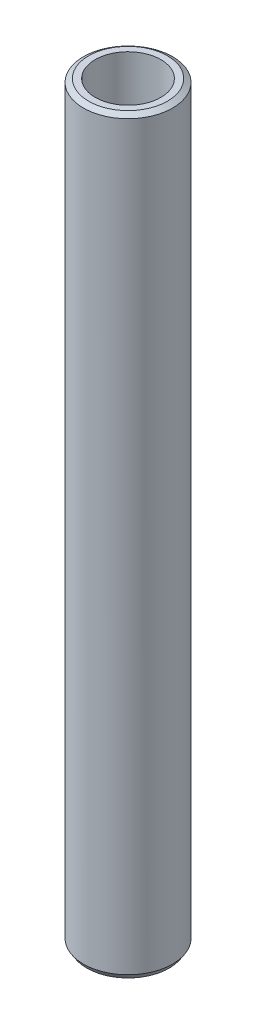
ISO-10303-21;
HEADER;
FILE_DESCRIPTION(('STEP AP214'),'2;1');
FILE_NAME('part.step','',(''),(''),'','','');
FILE_SCHEMA(('AUTOMOTIVE_DESIGN { 1 0 10303 214 1 1 1 1 }'));
ENDSEC;
DATA;
#1=APPLICATION_CONTEXT('core data for automotive mechanical design processes');
#2=APPLICATION_PROTOCOL_DEFINITION('international standard','automotive_design',2000,#1);
#3=PRODUCT_CONTEXT('',#1,'mechanical');
#4=PRODUCT('Part','Part','',(#3));
#5=PRODUCT_RELATED_PRODUCT_CATEGORY('part','',(#4));
#6=PRODUCT_DEFINITION_FORMATION('','',#4);
#7=PRODUCT_DEFINITION_CONTEXT('part definition',#1,'design');
#8=PRODUCT_DEFINITION('design','',#6,#7);
#9=PRODUCT_DEFINITION_SHAPE('','',#8);
#10=(LENGTH_UNIT() NAMED_UNIT(*) SI_UNIT(.MILLI.,.METRE.));
#11=(NAMED_UNIT(*) PLANE_ANGLE_UNIT() SI_UNIT($,.RADIAN.));
#12=(NAMED_UNIT(*) SI_UNIT($,.STERADIAN.) SOLID_ANGLE_UNIT());
#13=UNCERTAINTY_MEASURE_WITH_UNIT(LENGTH_MEASURE(1.E-05),#10,'distance_accuracy_value','');
#14=(GEOMETRIC_REPRESENTATION_CONTEXT(3) GLOBAL_UNCERTAINTY_ASSIGNED_CONTEXT((#13)) GLOBAL_UNIT_ASSIGNED_CONTEXT((#10,
#11,#12)) REPRESENTATION_CONTEXT('',''));
#15=CARTESIAN_POINT('',(0.,0.,0.));
#16=DIRECTION('',(0.,0.,1.));
#17=DIRECTION('',(1.,0.,0.));
#18=AXIS2_PLACEMENT_3D('',#15,#16,#17);
#19=CARTESIAN_POINT('',(0.,336.498548134909,0.));
#20=DIRECTION('',(0.,-1.,0.));
#21=DIRECTION('',(0.,0.,-1.));
#22=AXIS2_PLACEMENT_3D('',#19,#20,#21);
#23=CYLINDRICAL_SURFACE('',#22,20.);
#24=CARTESIAN_POINT('',(0.,334.996959689852,0.));
#25=DIRECTION('',(0.,1.,0.));
#26=DIRECTION('',(0.,0.,1.));
#27=AXIS2_PLACEMENT_3D('',#24,#25,#26);
#28=CIRCLE('',#27,20.);
#29=CARTESIAN_POINT('',(0.,334.996959689852,-20.));
#30=VERTEX_POINT('',#29);
#31=EDGE_CURVE('E50',#30,#30,#28,.F.);
#32=CARTESIAN_POINT('',(0.,2.32911628656407,0.));
#33=DIRECTION('',(0.,1.,0.));
#34=DIRECTION('',(0.,0.,1.));
#35=AXIS2_PLACEMENT_3D('',#32,#33,#34);
#36=CIRCLE('',#35,20.);
#37=CARTESIAN_POINT('',(0.,2.32911628656401,-20.));
#38=VERTEX_POINT('',#37);
#39=EDGE_CURVE('E51',#38,#38,#36,.T.);
#40=CARTESIAN_POINT('',(0.,334.996959689852,-20.));
#41=CARTESIAN_POINT('',(0.,331.531669654401,-20.));
#42=CARTESIAN_POINT('',(0.,328.06637961895,-20.));
#43=CARTESIAN_POINT('',(0.,321.135799548048,-20.));
#44=CARTESIAN_POINT('',(0.,317.670509512597,-20.));
#45=CARTESIAN_POINT('',(0.,310.739929441695,-20.));
#46=CARTESIAN_POINT('',(0.,307.274639406244,-20.));
#47=CARTESIAN_POINT('',(0.,300.344059335343,-20.));
#48=CARTESIAN_POINT('',(0.,296.878769299892,-20.));
#49=CARTESIAN_POINT('',(0.,289.94818922899,-20.));
#50=CARTESIAN_POINT('',(0.,286.482899193539,-20.));
#51=CARTESIAN_POINT('',(0.,279.552319122637,-20.));
#52=CARTESIAN_POINT('',(0.,276.087029087186,-20.));
#53=CARTESIAN_POINT('',(0.,269.156449016284,-20.));
#54=CARTESIAN_POINT('',(0.,265.691158980834,-20.));
#55=CARTESIAN_POINT('',(0.,258.760578909932,-20.));
#56=CARTESIAN_POINT('',(0.,255.295288874481,-20.));
#57=CARTESIAN_POINT('',(0.,248.364708803579,-20.));
#58=CARTESIAN_POINT('',(0.,244.899418768128,-20.));
#59=CARTESIAN_POINT('',(0.,237.968838697226,-20.));
#60=CARTESIAN_POINT('',(0.,234.503548661775,-20.));
#61=CARTESIAN_POINT('',(0.,227.572968590873,-20.));
#62=CARTESIAN_POINT('',(0.,224.107678555423,-20.));
#63=CARTESIAN_POINT('',(0.,217.177098484521,-20.));
#64=CARTESIAN_POINT('',(0.,213.71180844907,-20.));
#65=CARTESIAN_POINT('',(0.,206.781228378168,-20.));
#66=CARTESIAN_POINT('',(0.,203.315938342717,-20.));
#67=CARTESIAN_POINT('',(0.,196.385358271815,-20.));
#68=CARTESIAN_POINT('',(0.,192.920068236364,-20.));
#69=CARTESIAN_POINT('',(0.,185.989488165462,-20.));
#70=CARTESIAN_POINT('',(0.,182.524198130012,-20.));
#71=CARTESIAN_POINT('',(0.,175.59361805911,-20.));
#72=CARTESIAN_POINT('',(0.,172.128328023659,-20.));
#73=CARTESIAN_POINT('',(0.,165.197747952757,-20.));
#74=CARTESIAN_POINT('',(0.,161.732457917306,-20.));
#75=CARTESIAN_POINT('',(0.,154.801877846404,-20.));
#76=CARTESIAN_POINT('',(0.,151.336587810953,-20.));
#77=CARTESIAN_POINT('',(0.,144.406007740052,-20.));
#78=CARTESIAN_POINT('',(0.,140.940717704601,-20.));
#79=CARTESIAN_POINT('',(0.,134.010137633699,-20.));
#80=CARTESIAN_POINT('',(0.,130.544847598248,-20.));
#81=CARTESIAN_POINT('',(0.,123.614267527346,-20.));
#82=CARTESIAN_POINT('',(0.,120.148977491895,-20.));
#83=CARTESIAN_POINT('',(0.,113.218397420993,-20.));
#84=CARTESIAN_POINT('',(0.,109.753107385542,-20.));
#85=CARTESIAN_POINT('',(0.,102.822527314641,-20.));
#86=CARTESIAN_POINT('',(0.,99.3572372791896,-20.));
#87=CARTESIAN_POINT('',(0.,92.4266572082878,-20.));
#88=CARTESIAN_POINT('',(0.,88.9613671728369,-20.));
#89=CARTESIAN_POINT('',(0.,82.030787101935,-20.));
#90=CARTESIAN_POINT('',(0.,78.5654970664841,-20.));
#91=CARTESIAN_POINT('',(0.,71.6349169955823,-20.));
#92=CARTESIAN_POINT('',(0.,68.1696269601314,-20.));
#93=CARTESIAN_POINT('',(0.,61.2390468892295,-20.));
#94=CARTESIAN_POINT('',(0.,57.7737568537786,-20.));
#95=CARTESIAN_POINT('',(0.,50.8431767828768,-20.));
#96=CARTESIAN_POINT('',(0.,47.3778867474259,-20.));
#97=CARTESIAN_POINT('',(0.,40.4473066765241,-20.));
#98=CARTESIAN_POINT('',(0.,36.9820166410732,-20.));
#99=CARTESIAN_POINT('',(0.,30.0514365701713,-20.));
#100=CARTESIAN_POINT('',(0.,26.5861465347204,-20.));
#101=CARTESIAN_POINT('',(0.,19.6555664638186,-20.));
#102=CARTESIAN_POINT('',(0.,16.1902764283676,-20.));
#103=CARTESIAN_POINT('',(0.,9.2596963574658,-20.));
#104=CARTESIAN_POINT('',(0.,5.7944063220149,-20.));
#105=CARTESIAN_POINT('',(0.,2.32911628656401,-20.));
#106=B_SPLINE_CURVE_WITH_KNOTS('',3,(#40,#41,#42,#43,#44,#45,#46,#47,#48,#49,#50,#51,#52,#53,
#54,#55,#56,#57,#58,#59,#60,#61,#62,#63,#64,#65,#66,#67,#68,#69,#70,#71,#72,#73,#74,#75,#76,#77,
#78,#79,#80,#81,#82,#83,#84,#85,#86,#87,#88,#89,#90,#91,#92,#93,#94,#95,#96,#97,#98,#99,#100,
#101,#102,#103,#104,#105),.UNSPECIFIED.,.F.,.F.,(4,2,2,2,2,2,2,2,2,2,2,2,2,2,2,2,2,2,2,2,2,2,2,
2,2,2,2,2,2,2,2,2,4),(0.,10.3958701063527,20.7917402127055,31.1876103190582,41.5834804254109,
51.9793505317637,62.3752206381164,72.7710907444692,83.1669608508219,93.5628309571747,
103.958701063527,114.35457116988,124.750441276233,135.146311382586,145.542181488938,
155.938051595291,166.333921701644,176.729791807997,187.125661914349,197.521532020702,
207.917402127055,218.313272233408,228.70914233976,239.105012446113,249.500882552466,
259.896752658819,270.292622765171,280.688492871524,291.084362977877,301.480233084229,
311.876103190582,322.271973296935,332.667843403288),.UNSPECIFIED.);
#107=EDGE_CURVE('BSEAM39',#30,#38,#106,.T.);
#108=ORIENTED_EDGE('',*,*,#31,.T.);
#109=ORIENTED_EDGE('',*,*,#39,.T.);
#110=ORIENTED_EDGE('',*,*,#107,.T.);
#111=ORIENTED_EDGE('',*,*,#107,.F.);
#112=EDGE_LOOP('',(#108,#110,#109,#111));
#113=FACE_BOUND('',#112,.T.);
#114=ADVANCED_FACE('F39',(#113),#23,.T.);
#115=CARTESIAN_POINT('',(0.,336.498548134909,0.));
#116=DIRECTION('',(0.,1.,0.));
#117=DIRECTION('',(0.,0.,1.));
#118=AXIS2_PLACEMENT_3D('',#115,#116,#117);
#119=PLANE('',#118);
#120=CARTESIAN_POINT('',(0.,336.498548134909,0.));
#121=DIRECTION('',(0.,1.,0.));
#122=DIRECTION('',(0.,0.,1.));
#123=AXIS2_PLACEMENT_3D('',#120,#121,#122);
#124=CIRCLE('',#123,17.6708837134357);
#125=CARTESIAN_POINT('',(0.,336.498548134909,-17.6708837134357));
#126=VERTEX_POINT('',#125);
#127=EDGE_CURVE('E54',#126,#126,#124,.T.);
#128=ORIENTED_EDGE('',*,*,#127,.T.);
#129=EDGE_LOOP('',(#128));
#130=FACE_BOUND('',#129,.T.);
#131=CARTESIAN_POINT('',(0.,336.498548134909,0.));
#132=DIRECTION('',(0.,1.,0.));
#133=DIRECTION('',(0.,0.,1.));
#134=AXIS2_PLACEMENT_3D('',#131,#132,#133);
#135=CIRCLE('',#134,14.7234115133119);
#136=CARTESIAN_POINT('',(0.,336.498548134909,14.7234115133119));
#137=VERTEX_POINT('',#136);
#138=EDGE_CURVE('E58',#137,#137,#135,.T.);
#139=ORIENTED_EDGE('',*,*,#138,.F.);
#140=EDGE_LOOP('',(#139));
#141=FACE_BOUND('',#140,.T.);
#142=ADVANCED_FACE('F69',(#130,#141),#119,.T.);
#143=CARTESIAN_POINT('',(0.,0.,0.));
#144=DIRECTION('',(0.,1.,0.));
#145=DIRECTION('',(0.,0.,1.));
#146=AXIS2_PLACEMENT_3D('',#143,#144,#145);
#147=PLANE('',#146);
#148=CARTESIAN_POINT('',(0.,0.,0.));
#149=DIRECTION('',(0.,1.,0.));
#150=DIRECTION('',(0.,0.,1.));
#151=AXIS2_PLACEMENT_3D('',#148,#149,#150);
#152=CIRCLE('',#151,18.4984115549432);
#153=CARTESIAN_POINT('',(0.,0.,18.4984115549432));
#154=VERTEX_POINT('',#153);
#155=EDGE_CURVE('E10',#154,#154,#152,.F.);
#156=ORIENTED_EDGE('',*,*,#155,.T.);
#157=EDGE_LOOP('',(#156));
#158=FACE_BOUND('',#157,.T.);
#159=CARTESIAN_POINT('',(0.,0.,0.));
#160=DIRECTION('',(0.,1.,0.));
#161=DIRECTION('',(0.,0.,1.));
#162=AXIS2_PLACEMENT_3D('',#159,#160,#161);
#163=CIRCLE('',#162,14.7234115133119);
#164=CARTESIAN_POINT('',(0.,0.,14.7234115133119));
#165=VERTEX_POINT('',#164);
#166=EDGE_CURVE('E63',#165,#165,#163,.T.);
#167=ORIENTED_EDGE('',*,*,#166,.T.);
#168=EDGE_LOOP('',(#167));
#169=FACE_BOUND('',#168,.T.);
#170=ADVANCED_FACE('F75',(#158,#169),#147,.F.);
#171=CARTESIAN_POINT('',(0.,336.498548134909,0.));
#172=DIRECTION('',(0.,-1.,0.));
#173=DIRECTION('',(0.,0.,-1.));
#174=AXIS2_PLACEMENT_3D('',#171,#172,#173);
#175=CYLINDRICAL_SURFACE('',#174,14.7234115133119);
#176=ORIENTED_EDGE('',*,*,#138,.T.);
#177=EDGE_LOOP('',(#176));
#178=FACE_BOUND('',#177,.T.);
#179=ORIENTED_EDGE('',*,*,#166,.F.);
#180=EDGE_LOOP('',(#179));
#181=FACE_BOUND('',#180,.T.);
#182=ADVANCED_FACE('F70',(#178,#181),#175,.F.);
#183=CARTESIAN_POINT('',(0.,336.498548134909,0.));
#184=DIRECTION('',(0.,-1.,0.));
#185=DIRECTION('',(0.,0.,-1.));
#186=AXIS2_PLACEMENT_3D('',#183,#184,#185);
#187=CONICAL_SURFACE('',#186,17.6708837134357,0.998153792611793);
#188=CARTESIAN_POINT('',(0.,334.996959689852,-20.));
#189=CARTESIAN_POINT('',(0.,335.012601236154,-19.975738372015));
#190=CARTESIAN_POINT('',(0.,335.028242782457,-19.9514767440299));
#191=CARTESIAN_POINT('',(0.,335.059525875062,-19.9029534880599));
#192=CARTESIAN_POINT('',(0.,335.075167421365,-19.8786918600748));
#193=CARTESIAN_POINT('',(0.,335.106450513971,-19.8301686041047));
#194=CARTESIAN_POINT('',(0.,335.122092060273,-19.8059069761197));
#195=CARTESIAN_POINT('',(0.,335.153375152879,-19.7573837201496));
#196=CARTESIAN_POINT('',(0.,335.169016699181,-19.7331220921646));
#197=CARTESIAN_POINT('',(0.,335.200299791787,-19.6845988361945));
#198=CARTESIAN_POINT('',(0.,335.215941338089,-19.6603372082094));
#199=CARTESIAN_POINT('',(0.,335.247224430695,-19.6118139522393));
#200=CARTESIAN_POINT('',(0.,335.262865976997,-19.5875523242543));
#201=CARTESIAN_POINT('',(0.,335.294149069603,-19.5390290682842));
#202=CARTESIAN_POINT('',(0.,335.309790615905,-19.5147674402991));
#203=CARTESIAN_POINT('',(0.,335.341073708511,-19.4662441843291));
#204=CARTESIAN_POINT('',(0.,335.356715254813,-19.441982556344));
#205=CARTESIAN_POINT('',(0.,335.387998347419,-19.3934593003739));
#206=CARTESIAN_POINT('',(0.,335.403639893721,-19.3691976723889));
#207=CARTESIAN_POINT('',(0.,335.434922986327,-19.3206744164188));
#208=CARTESIAN_POINT('',(0.,335.450564532629,-19.2964127884337));
#209=CARTESIAN_POINT('',(0.,335.481847625235,-19.2478895324636));
#210=CARTESIAN_POINT('',(0.,335.497489171537,-19.2236279044786));
#211=CARTESIAN_POINT('',(0.,335.528772264143,-19.1751046485085));
#212=CARTESIAN_POINT('',(0.,335.544413810445,-19.1508430205235));
#213=CARTESIAN_POINT('',(0.,335.575696903051,-19.1023197645534));
#214=CARTESIAN_POINT('',(0.,335.591338449353,-19.0780581365683));
#215=CARTESIAN_POINT('',(0.,335.622621541959,-19.0295348805982));
#216=CARTESIAN_POINT('',(0.,335.638263088262,-19.0052732526132));
#217=CARTESIAN_POINT('',(0.,335.669546180867,-18.9567499966431));
#218=CARTESIAN_POINT('',(0.,335.68518772717,-18.9324883686581));
#219=CARTESIAN_POINT('',(0.,335.716470819775,-18.883965112688));
#220=CARTESIAN_POINT('',(0.,335.732112366078,-18.8597034847029));
#221=CARTESIAN_POINT('',(0.,335.763395458683,-18.8111802287328));
#222=CARTESIAN_POINT('',(0.,335.779037004986,-18.7869186007478));
#223=CARTESIAN_POINT('',(0.,335.810320097591,-18.7383953447777));
#224=CARTESIAN_POINT('',(0.,335.825961643894,-18.7141337167926));
#225=CARTESIAN_POINT('',(0.,335.857244736499,-18.6656104608226));
#226=CARTESIAN_POINT('',(0.,335.872886282802,-18.6413488328375));
#227=CARTESIAN_POINT('',(0.,335.904169375407,-18.5928255768674));
#228=CARTESIAN_POINT('',(0.,335.91981092171,-18.5685639488824));
#229=CARTESIAN_POINT('',(0.,335.951094014315,-18.5200406929123));
#230=CARTESIAN_POINT('',(0.,335.966735560618,-18.4957790649272));
#231=CARTESIAN_POINT('',(0.,335.998018653223,-18.4472558089572));
#232=CARTESIAN_POINT('',(0.,336.013660199526,-18.4229941809721));
#233=CARTESIAN_POINT('',(0.,336.044943292131,-18.374470925002));
#234=CARTESIAN_POINT('',(0.,336.060584838434,-18.350209297017));
#235=CARTESIAN_POINT('',(0.,336.091867931039,-18.3016860410469));
#236=CARTESIAN_POINT('',(0.,336.107509477342,-18.2774244130618));
#237=CARTESIAN_POINT('',(0.,336.138792569947,-18.2289011570918));
#238=CARTESIAN_POINT('',(0.,336.15443411625,-18.2046395291067));
#239=CARTESIAN_POINT('',(0.,336.185717208855,-18.1561162731366));
#240=CARTESIAN_POINT('',(0.,336.201358755158,-18.1318546451516));
#241=CARTESIAN_POINT('',(0.,336.232641847763,-18.0833313891815));
#242=CARTESIAN_POINT('',(0.,336.248283394066,-18.0590697611964));
#243=CARTESIAN_POINT('',(0.,336.279566486671,-18.0105465052263));
#244=CARTESIAN_POINT('',(0.,336.295208032974,-17.9862848772413));
#245=CARTESIAN_POINT('',(0.,336.326491125579,-17.9377616212712));
#246=CARTESIAN_POINT('',(0.,336.342132671882,-17.9134999932862));
#247=CARTESIAN_POINT('',(0.,336.373415764487,-17.8649767373161));
#248=CARTESIAN_POINT('',(0.,336.38905731079,-17.840715109331));
#249=CARTESIAN_POINT('',(0.,336.420340403395,-17.7921918533609));
#250=CARTESIAN_POINT('',(0.,336.435981949698,-17.7679302253759));
#251=CARTESIAN_POINT('',(0.,336.467265042303,-17.7194069694058));
#252=CARTESIAN_POINT('',(0.,336.482906588606,-17.6951453414208));
#253=CARTESIAN_POINT('',(0.,336.498548134909,-17.6708837134357));
#254=B_SPLINE_CURVE_WITH_KNOTS('',3,(#188,#189,#190,#191,#192,#193,#194,#195,#196,#197,#198,
#199,#200,#201,#202,#203,#204,#205,#206,#207,#208,#209,#210,#211,#212,#213,#214,#215,#216,#217,
#218,#219,#220,#221,#222,#223,#224,#225,#226,#227,#228,#229,#230,#231,#232,#233,#234,#235,#236,
#237,#238,#239,#240,#241,#242,#243,#244,#245,#246,#247,#248,#249,#250,#251,#252,#253),
.UNSPECIFIED.,.F.,.F.,(4,2,2,2,2,2,2,2,2,2,2,2,2,2,2,2,2,2,2,2,2,2,2,2,2,2,2,2,2,2,2,2,4),(0.,
0.0866000061720968,0.173200012344224,0.259800018516353,0.34640002468848,0.433000030860577,
0.519600037032707,0.606200043204834,0.69280004937696,0.77940005554906,0.866000061721187,
0.952600067893314,1.03920007406544,1.12580008023754,1.21240008640967,1.2990000925818,
1.38560009875392,1.47220010492602,1.55880011109815,1.64540011727028,1.73200012344241,
1.8186001296145,1.90520013578663,1.99180014195876,2.07840014813089,2.16500015430298,
2.25160016047511,2.33820016664724,2.42480017281937,2.51140017899147,2.59800018516359,
2.68460019133572,2.77120019750785),.UNSPECIFIED.);
#255=EDGE_CURVE('BSEAM81',#30,#126,#254,.T.);
#256=ORIENTED_EDGE('',*,*,#31,.F.);
#257=ORIENTED_EDGE('',*,*,#127,.F.);
#258=ORIENTED_EDGE('',*,*,#255,.T.);
#259=ORIENTED_EDGE('',*,*,#255,.F.);
#260=EDGE_LOOP('',(#256,#258,#257,#259));
#261=FACE_BOUND('',#260,.T.);
#262=ADVANCED_FACE('F81',(#261),#187,.T.);
#263=CARTESIAN_POINT('',(0.,2.32911628656407,0.));
#264=DIRECTION('',(0.,1.,0.));
#265=DIRECTION('',(0.,0.,1.));
#266=AXIS2_PLACEMENT_3D('',#263,#264,#265);
#267=CONICAL_SURFACE('',#266,20.,0.572642534183124);
#268=ORIENTED_EDGE('',*,*,#155,.F.);
#269=EDGE_LOOP('',(#268));
#270=FACE_BOUND('',#269,.T.);
#271=ORIENTED_EDGE('',*,*,#39,.F.);
#272=EDGE_LOOP('',(#271));
#273=FACE_BOUND('',#272,.T.);
#274=ADVANCED_FACE('F45',(#270,#273),#267,.T.);
#275=CLOSED_SHELL('',(#114,#142,#170,#182,#262,#274));
#276=MANIFOLD_SOLID_BREP('B2',#275);
#277=ADVANCED_BREP_SHAPE_REPRESENTATION('',(#18,#276),#14);
#278=SHAPE_DEFINITION_REPRESENTATION(#9,#277);
ENDSEC;
END-ISO-10303-21;
